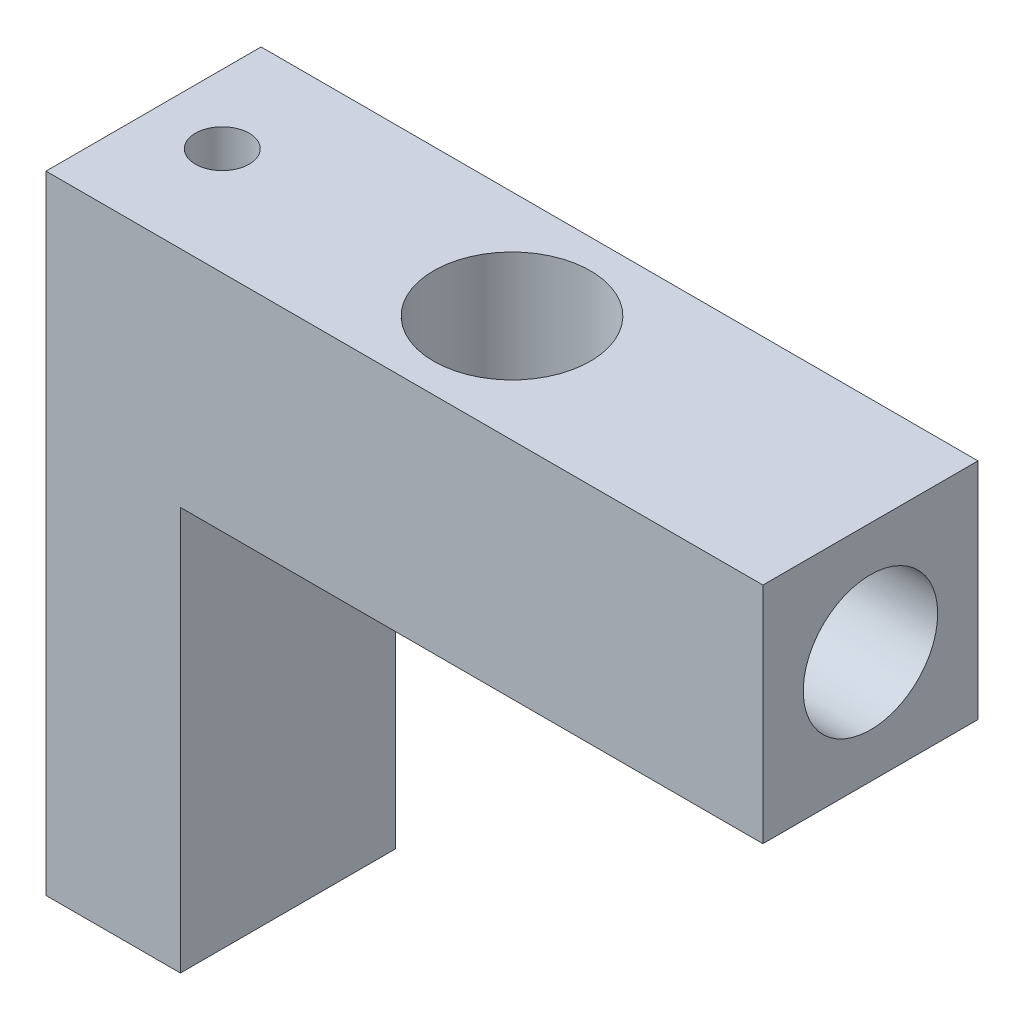
ISO-10303-21;
HEADER;
FILE_DESCRIPTION(('STEP AP214'),'2;1');
FILE_NAME('part.step','',(''),(''),'','','');
FILE_SCHEMA(('AUTOMOTIVE_DESIGN { 1 0 10303 214 1 1 1 1 }'));
ENDSEC;
DATA;
#1=APPLICATION_CONTEXT('core data for automotive mechanical design processes');
#2=APPLICATION_PROTOCOL_DEFINITION('international standard','automotive_design',2000,#1);
#3=PRODUCT_CONTEXT('',#1,'mechanical');
#4=PRODUCT('Part','Part','',(#3));
#5=PRODUCT_RELATED_PRODUCT_CATEGORY('part','',(#4));
#6=PRODUCT_DEFINITION_FORMATION('','',#4);
#7=PRODUCT_DEFINITION_CONTEXT('part definition',#1,'design');
#8=PRODUCT_DEFINITION('design','',#6,#7);
#9=PRODUCT_DEFINITION_SHAPE('','',#8);
#10=(LENGTH_UNIT() NAMED_UNIT(*) SI_UNIT(.MILLI.,.METRE.));
#11=(NAMED_UNIT(*) PLANE_ANGLE_UNIT() SI_UNIT($,.RADIAN.));
#12=(NAMED_UNIT(*) SI_UNIT($,.STERADIAN.) SOLID_ANGLE_UNIT());
#13=UNCERTAINTY_MEASURE_WITH_UNIT(LENGTH_MEASURE(1.E-05),#10,'distance_accuracy_value','');
#14=(GEOMETRIC_REPRESENTATION_CONTEXT(3) GLOBAL_UNCERTAINTY_ASSIGNED_CONTEXT((#13)) GLOBAL_UNIT_ASSIGNED_CONTEXT((#10,
#11,#12)) REPRESENTATION_CONTEXT('',''));
#15=CARTESIAN_POINT('',(0.,0.,0.));
#16=DIRECTION('',(0.,0.,1.));
#17=DIRECTION('',(1.,0.,0.));
#18=AXIS2_PLACEMENT_3D('',#15,#16,#17);
#19=CARTESIAN_POINT('',(0.,0.,0.));
#20=DIRECTION('',(0.,1.,0.));
#21=DIRECTION('',(0.,0.,1.));
#22=AXIS2_PLACEMENT_3D('',#19,#20,#21);
#23=PLANE('',#22);
#24=CARTESIAN_POINT('',(0.,0.,0.));
#25=DIRECTION('',(0.,1.,0.));
#26=DIRECTION('',(0.,0.,1.));
#27=AXIS2_PLACEMENT_3D('',#24,#25,#26);
#28=CIRCLE('',#27,1.75);
#29=CARTESIAN_POINT('',(0.,0.,1.75));
#30=VERTEX_POINT('',#29);
#31=EDGE_CURVE('E160',#30,#30,#28,.T.);
#32=ORIENTED_EDGE('',*,*,#31,.T.);
#33=EDGE_LOOP('',(#32));
#34=FACE_BOUND('',#33,.T.);
#35=DIRECTION('',(0.,0.,1.));
#36=VECTOR('',#35,1.);
#37=CARTESIAN_POINT('',(-5.,0.,2.4));
#38=LINE('',#37,#36);
#39=CARTESIAN_POINT('',(-5.,0.,-2.4));
#40=VERTEX_POINT('',#39);
#41=CARTESIAN_POINT('',(-5.,0.,2.4));
#42=VERTEX_POINT('',#41);
#43=EDGE_CURVE('E61',#40,#42,#38,.T.);
#44=ORIENTED_EDGE('',*,*,#43,.F.);
#45=DIRECTION('',(-1.,0.,0.));
#46=VECTOR('',#45,1.);
#47=CARTESIAN_POINT('',(8.,0.,-2.4));
#48=LINE('',#47,#46);
#49=CARTESIAN_POINT('',(8.,0.,-2.4));
#50=VERTEX_POINT('',#49);
#51=EDGE_CURVE('E175',#50,#40,#48,.T.);
#52=ORIENTED_EDGE('',*,*,#51,.F.);
#53=DIRECTION('',(0.,0.,-1.));
#54=VECTOR('',#53,1.);
#55=CARTESIAN_POINT('',(8.,0.,2.4));
#56=LINE('',#55,#54);
#57=CARTESIAN_POINT('',(8.,0.,2.4));
#58=VERTEX_POINT('',#57);
#59=EDGE_CURVE('E86',#58,#50,#56,.T.);
#60=ORIENTED_EDGE('',*,*,#59,.F.);
#61=DIRECTION('',(1.,0.,0.));
#62=VECTOR('',#61,1.);
#63=CARTESIAN_POINT('',(8.,0.,2.4));
#64=LINE('',#63,#62);
#65=EDGE_CURVE('E169',#42,#58,#64,.T.);
#66=ORIENTED_EDGE('',*,*,#65,.F.);
#67=EDGE_LOOP('',(#44,#52,#60,#66));
#68=FACE_BOUND('',#67,.T.);
#69=ADVANCED_FACE('F39',(#34,#68),#23,.F.);
#70=CARTESIAN_POINT('',(0.,5.,0.));
#71=DIRECTION('',(0.,1.,0.));
#72=DIRECTION('',(0.,0.,1.));
#73=AXIS2_PLACEMENT_3D('',#70,#71,#72);
#74=PLANE('',#73);
#75=CARTESIAN_POINT('',(-6.46588902284861,5.,0.));
#76=DIRECTION('',(0.,-1.,0.));
#77=DIRECTION('',(0.,0.,-1.));
#78=AXIS2_PLACEMENT_3D('',#75,#76,#77);
#79=CIRCLE('',#78,0.6);
#80=CARTESIAN_POINT('',(-6.46588902284861,5.,-0.6));
#81=VERTEX_POINT('',#80);
#82=EDGE_CURVE('E136',#81,#81,#79,.T.);
#83=ORIENTED_EDGE('',*,*,#82,.T.);
#84=EDGE_LOOP('',(#83));
#85=FACE_BOUND('',#84,.T.);
#86=DIRECTION('',(0.,0.,1.));
#87=VECTOR('',#86,1.);
#88=CARTESIAN_POINT('',(-8.,5.,2.4));
#89=LINE('',#88,#87);
#90=CARTESIAN_POINT('',(-8.,5.,-2.4));
#91=VERTEX_POINT('',#90);
#92=CARTESIAN_POINT('',(-8.,5.,2.4));
#93=VERTEX_POINT('',#92);
#94=EDGE_CURVE('E114',#91,#93,#89,.T.);
#95=ORIENTED_EDGE('',*,*,#94,.T.);
#96=DIRECTION('',(1.,0.,0.));
#97=VECTOR('',#96,1.);
#98=CARTESIAN_POINT('',(8.,5.,2.4));
#99=LINE('',#98,#97);
#100=CARTESIAN_POINT('',(8.,5.,2.4));
#101=VERTEX_POINT('',#100);
#102=EDGE_CURVE('E93',#93,#101,#99,.T.);
#103=ORIENTED_EDGE('',*,*,#102,.T.);
#104=DIRECTION('',(0.,0.,-1.));
#105=VECTOR('',#104,1.);
#106=CARTESIAN_POINT('',(8.,5.,2.4));
#107=LINE('',#106,#105);
#108=CARTESIAN_POINT('',(8.,5.,-2.4));
#109=VERTEX_POINT('',#108);
#110=EDGE_CURVE('E178',#101,#109,#107,.T.);
#111=ORIENTED_EDGE('',*,*,#110,.T.);
#112=DIRECTION('',(-1.,0.,0.));
#113=VECTOR('',#112,1.);
#114=CARTESIAN_POINT('',(8.,5.,-2.4));
#115=LINE('',#114,#113);
#116=EDGE_CURVE('E70',#109,#91,#115,.T.);
#117=ORIENTED_EDGE('',*,*,#116,.T.);
#118=EDGE_LOOP('',(#95,#103,#111,#117));
#119=FACE_BOUND('',#118,.T.);
#120=CARTESIAN_POINT('',(0.,5.,0.));
#121=DIRECTION('',(0.,1.,0.));
#122=DIRECTION('',(0.,0.,1.));
#123=AXIS2_PLACEMENT_3D('',#120,#121,#122);
#124=CIRCLE('',#123,1.75);
#125=CARTESIAN_POINT('',(0.,5.,1.75));
#126=VERTEX_POINT('',#125);
#127=EDGE_CURVE('E165',#126,#126,#124,.T.);
#128=ORIENTED_EDGE('',*,*,#127,.F.);
#129=EDGE_LOOP('',(#128));
#130=FACE_BOUND('',#129,.T.);
#131=ADVANCED_FACE('F205',(#85,#119,#130),#74,.T.);
#132=CARTESIAN_POINT('',(-8.,5.,2.4));
#133=DIRECTION('',(1.,0.,0.));
#134=DIRECTION('',(0.,0.,-1.));
#135=AXIS2_PLACEMENT_3D('',#132,#133,#134);
#136=PLANE('',#135);
#137=DIRECTION('',(0.,-1.,0.));
#138=VECTOR('',#137,1.);
#139=CARTESIAN_POINT('',(-8.,5.,-2.4));
#140=LINE('',#139,#138);
#141=CARTESIAN_POINT('',(-8.,-9.,-2.4));
#142=VERTEX_POINT('',#141);
#143=EDGE_CURVE('E109',#91,#142,#140,.T.);
#144=ORIENTED_EDGE('',*,*,#143,.T.);
#145=DIRECTION('',(0.,0.,-1.));
#146=VECTOR('',#145,1.);
#147=CARTESIAN_POINT('',(-8.,-9.,2.4));
#148=LINE('',#147,#146);
#149=CARTESIAN_POINT('',(-8.,-9.,2.4));
#150=VERTEX_POINT('',#149);
#151=EDGE_CURVE('E113',#150,#142,#148,.T.);
#152=ORIENTED_EDGE('',*,*,#151,.F.);
#153=DIRECTION('',(0.,-1.,0.));
#154=VECTOR('',#153,1.);
#155=CARTESIAN_POINT('',(-8.,5.,2.4));
#156=LINE('',#155,#154);
#157=EDGE_CURVE('E11',#93,#150,#156,.T.);
#158=ORIENTED_EDGE('',*,*,#157,.F.);
#159=ORIENTED_EDGE('',*,*,#94,.F.);
#160=EDGE_LOOP('',(#144,#152,#158,#159));
#161=FACE_BOUND('',#160,.T.);
#162=ADVANCED_FACE('F41',(#161),#136,.F.);
#163=CARTESIAN_POINT('',(8.,5.,2.4));
#164=DIRECTION('',(0.,0.,-1.));
#165=DIRECTION('',(-1.,0.,0.));
#166=AXIS2_PLACEMENT_3D('',#163,#164,#165);
#167=PLANE('',#166);
#168=ORIENTED_EDGE('',*,*,#157,.T.);
#169=DIRECTION('',(-1.,0.,0.));
#170=VECTOR('',#169,1.);
#171=CARTESIAN_POINT('',(-8.,-9.,2.4));
#172=LINE('',#171,#170);
#173=CARTESIAN_POINT('',(-5.,-9.,2.4));
#174=VERTEX_POINT('',#173);
#175=EDGE_CURVE('E132',#174,#150,#172,.T.);
#176=ORIENTED_EDGE('',*,*,#175,.F.);
#177=DIRECTION('',(0.,1.,0.));
#178=VECTOR('',#177,1.);
#179=CARTESIAN_POINT('',(-5.,-9.,2.4));
#180=LINE('',#179,#178);
#181=EDGE_CURVE('E145',#174,#42,#180,.T.);
#182=ORIENTED_EDGE('',*,*,#181,.T.);
#183=ORIENTED_EDGE('',*,*,#65,.T.);
#184=DIRECTION('',(0.,-1.,0.));
#185=VECTOR('',#184,1.);
#186=CARTESIAN_POINT('',(8.,5.,2.4));
#187=LINE('',#186,#185);
#188=EDGE_CURVE('E54',#101,#58,#187,.T.);
#189=ORIENTED_EDGE('',*,*,#188,.F.);
#190=ORIENTED_EDGE('',*,*,#102,.F.);
#191=EDGE_LOOP('',(#168,#176,#182,#183,#189,#190));
#192=FACE_BOUND('',#191,.T.);
#193=ADVANCED_FACE('F197',(#192),#167,.F.);
#194=CARTESIAN_POINT('',(8.,5.,2.4));
#195=DIRECTION('',(-1.,0.,0.));
#196=DIRECTION('',(0.,0.,1.));
#197=AXIS2_PLACEMENT_3D('',#194,#195,#196);
#198=PLANE('',#197);
#199=CARTESIAN_POINT('',(8.,2.5,0.));
#200=DIRECTION('',(1.,0.,0.));
#201=DIRECTION('',(0.,0.,-1.));
#202=AXIS2_PLACEMENT_3D('',#199,#200,#201);
#203=CIRCLE('',#202,1.5);
#204=CARTESIAN_POINT('',(8.,2.5,-1.5));
#205=VERTEX_POINT('',#204);
#206=EDGE_CURVE('E161',#205,#205,#203,.T.);
#207=ORIENTED_EDGE('',*,*,#206,.F.);
#208=EDGE_LOOP('',(#207));
#209=FACE_BOUND('',#208,.T.);
#210=ORIENTED_EDGE('',*,*,#59,.T.);
#211=DIRECTION('',(0.,-1.,0.));
#212=VECTOR('',#211,1.);
#213=CARTESIAN_POINT('',(8.,5.,-2.4));
#214=LINE('',#213,#212);
#215=EDGE_CURVE('E117',#109,#50,#214,.T.);
#216=ORIENTED_EDGE('',*,*,#215,.F.);
#217=ORIENTED_EDGE('',*,*,#110,.F.);
#218=ORIENTED_EDGE('',*,*,#188,.T.);
#219=EDGE_LOOP('',(#210,#216,#217,#218));
#220=FACE_BOUND('',#219,.T.);
#221=ADVANCED_FACE('F193',(#209,#220),#198,.F.);
#222=CARTESIAN_POINT('',(8.,5.,-2.4));
#223=DIRECTION('',(0.,0.,1.));
#224=DIRECTION('',(1.,0.,0.));
#225=AXIS2_PLACEMENT_3D('',#222,#223,#224);
#226=PLANE('',#225);
#227=ORIENTED_EDGE('',*,*,#51,.T.);
#228=DIRECTION('',(0.,1.,0.));
#229=VECTOR('',#228,1.);
#230=CARTESIAN_POINT('',(-5.,-9.,-2.4));
#231=LINE('',#230,#229);
#232=CARTESIAN_POINT('',(-5.,-9.,-2.4));
#233=VERTEX_POINT('',#232);
#234=EDGE_CURVE('E123',#233,#40,#231,.T.);
#235=ORIENTED_EDGE('',*,*,#234,.F.);
#236=DIRECTION('',(1.,0.,0.));
#237=VECTOR('',#236,1.);
#238=CARTESIAN_POINT('',(-8.,-9.,-2.4));
#239=LINE('',#238,#237);
#240=EDGE_CURVE('E120',#142,#233,#239,.T.);
#241=ORIENTED_EDGE('',*,*,#240,.F.);
#242=ORIENTED_EDGE('',*,*,#143,.F.);
#243=ORIENTED_EDGE('',*,*,#116,.F.);
#244=ORIENTED_EDGE('',*,*,#215,.T.);
#245=EDGE_LOOP('',(#227,#235,#241,#242,#243,#244));
#246=FACE_BOUND('',#245,.T.);
#247=ADVANCED_FACE('F121',(#246),#226,.F.);
#248=CARTESIAN_POINT('',(0.,5.,0.));
#249=DIRECTION('',(0.,-1.,0.));
#250=DIRECTION('',(0.,0.,-1.));
#251=AXIS2_PLACEMENT_3D('',#248,#249,#250);
#252=CYLINDRICAL_SURFACE('',#251,1.75);
#253=CARTESIAN_POINT('',(1.66132477258362,2.5,-0.55));
#254=CARTESIAN_POINT('',(1.66132493750972,2.46993686582327,-0.54999982321884));
#255=CARTESIAN_POINT('',(1.66214972896379,2.43987190685431,-0.547526746616077));
#256=CARTESIAN_POINT('',(1.66534498206602,2.38062587690329,-0.537728501989825));
#257=CARTESIAN_POINT('',(1.6677158473173,2.35144503880341,-0.530402066987436));
#258=CARTESIAN_POINT('',(1.6737087700032,2.29483406633599,-0.511174397005002));
#259=CARTESIAN_POINT('',(1.67732859266841,2.26740090799528,-0.499281328876751));
#260=CARTESIAN_POINT('',(1.68540845010023,2.21491152300886,-0.471285299993899));
#261=CARTESIAN_POINT('',(1.68986863647378,2.18985572648259,-0.455181579407266));
#262=CARTESIAN_POINT('',(1.6993004987853,2.14196165795903,-0.418622094988196));
#263=CARTESIAN_POINT('',(1.7042838636915,2.11921814353238,-0.398045182088362));
#264=CARTESIAN_POINT('',(1.71410117830469,2.07744114695325,-0.353382595201496));
#265=CARTESIAN_POINT('',(1.71893510681755,2.05840818904517,-0.329296426249482));
#266=CARTESIAN_POINT('',(1.72804273835545,2.0241734564028,-0.277617107045007));
#267=CARTESIAN_POINT('',(1.73230107521367,2.00906940912716,-0.249956271666683));
#268=CARTESIAN_POINT('',(1.73964112323645,1.98376494970475,-0.19233025486475));
#269=CARTESIAN_POINT('',(1.74272311427468,1.97356337102332,-0.162365623596166));
#270=CARTESIAN_POINT('',(1.74728047242685,1.95867023429237,-0.101974873867498));
#271=CARTESIAN_POINT('',(1.74880296770252,1.95381668861185,-0.0715923252630936));
#272=CARTESIAN_POINT('',(1.75023630918134,1.94924399629186,-0.0104085235998297));
#273=CARTESIAN_POINT('',(1.75014752581693,1.94952366952721,0.0203926315944382));
#274=CARTESIAN_POINT('',(1.74840105558102,1.9551032323404,0.0803986868552374));
#275=CARTESIAN_POINT('',(1.74679825777856,1.96022749190045,0.109621770893423));
#276=CARTESIAN_POINT('',(1.74227147615191,1.97506240290688,0.166769965471235));
#277=CARTESIAN_POINT('',(1.73934740583623,1.9847733546035,0.194694990906955));
#278=CARTESIAN_POINT('',(1.73243326495131,2.00861796605645,0.24885782826664));
#279=CARTESIAN_POINT('',(1.7284305040595,2.02280464392539,0.275070612750757));
#280=CARTESIAN_POINT('',(1.71978029690319,2.05515537453754,0.324797933430703));
#281=CARTESIAN_POINT('',(1.71513268630115,2.0733204418432,0.348311779011997));
#282=CARTESIAN_POINT('',(1.70545599317789,2.11401264026693,0.393020819989259));
#283=CARTESIAN_POINT('',(1.70041908844632,2.13669129938688,0.41407660098063));
#284=CARTESIAN_POINT('',(1.69070014648252,2.18530452271734,0.452127956140296));
#285=CARTESIAN_POINT('',(1.68601815209932,2.21123947906626,0.469123040583905));
#286=CARTESIAN_POINT('',(1.67749939777943,2.26602696573684,0.498735288931937));
#287=CARTESIAN_POINT('',(1.67367290414621,2.2949094400216,0.511300224942783));
#288=CARTESIAN_POINT('',(1.66741867882843,2.35452963265562,0.531344027349455));
#289=CARTESIAN_POINT('',(1.66499043778638,2.38526667090804,0.538824746010644));
#290=CARTESIAN_POINT('',(1.66192089910417,2.44638652924762,0.548217564420321));
#291=CARTESIAN_POINT('',(1.66121106783229,2.47673308328049,0.550343376566184));
#292=CARTESIAN_POINT('',(1.66146833067353,2.53735158513708,0.549566448015891));
#293=CARTESIAN_POINT('',(1.66243516202284,2.56762354390671,0.54666449526284));
#294=CARTESIAN_POINT('',(1.66586909555842,2.62630918343245,0.536105496273811));
#295=CARTESIAN_POINT('',(1.66829132383563,2.65475132812454,0.528590537492945));
#296=CARTESIAN_POINT('',(1.67431542979503,2.70996761665544,0.50918597575023));
#297=CARTESIAN_POINT('',(1.67791750131633,2.73674148554855,0.497295653910404));
#298=CARTESIAN_POINT('',(1.68602481992422,2.78871881780402,0.469085320193651));
#299=CARTESIAN_POINT('',(1.69055318847098,2.81385440818007,0.452647069469823));
#300=CARTESIAN_POINT('',(1.6999552513153,2.86108816772894,0.415945193594723));
#301=CARTESIAN_POINT('',(1.70482903613026,2.88318553623292,0.395680563396317));
#302=CARTESIAN_POINT('',(1.71462041535391,2.92467292644771,0.350889093909756));
#303=CARTESIAN_POINT('',(1.71953125571284,2.94391030107764,0.326219011785775));
#304=CARTESIAN_POINT('',(1.72863911988479,2.97797848775901,0.27388186393735));
#305=CARTESIAN_POINT('',(1.73283617590213,2.99280949863811,0.246214933516121));
#306=CARTESIAN_POINT('',(1.74001990641037,3.01750202146644,0.188837580641653));
#307=CARTESIAN_POINT('',(1.7430152570996,3.02739928544751,0.15914368663398));
#308=CARTESIAN_POINT('',(1.74749620366367,3.04202591394991,0.098401927472108));
#309=CARTESIAN_POINT('',(1.74898227794364,3.04675691609054,0.0673544946143246));
#310=CARTESIAN_POINT('',(1.75024516297117,3.05078247532423,0.00619134984853068));
#311=CARTESIAN_POINT('',(1.75009126306077,3.0502974046969,-0.0239085977126394));
#312=CARTESIAN_POINT('',(1.74825784491332,3.04443839961653,-0.0835786981473618));
#313=CARTESIAN_POINT('',(1.74657842809307,3.03906479015494,-0.113148886106231));
#314=CARTESIAN_POINT('',(1.74190490145202,3.02372209524057,-0.170548438721182));
#315=CARTESIAN_POINT('',(1.73892786037387,3.01381259207947,-0.19839521612821));
#316=CARTESIAN_POINT('',(1.73196603085874,2.98973332312355,-0.252044120764177));
#317=CARTESIAN_POINT('',(1.72798106865151,2.97556282263348,-0.277845894416586));
#318=CARTESIAN_POINT('',(1.71924924924425,2.94280372281994,-0.327632340752122));
#319=CARTESIAN_POINT('',(1.71448100237665,2.92408064238532,-0.351524734952143));
#320=CARTESIAN_POINT('',(1.70478118030165,2.88298433239211,-0.395901600363276));
#321=CARTESIAN_POINT('',(1.69984955631279,2.86061000466386,-0.416385042523484));
#322=CARTESIAN_POINT('',(1.69018427609254,2.81194478129564,-0.454057993491287));
#323=CARTESIAN_POINT('',(1.68546285173412,2.78554749151355,-0.471113590440285));
#324=CARTESIAN_POINT('',(1.67696362359322,2.73011887538269,-0.500528421153911));
#325=CARTESIAN_POINT('',(1.67318544915138,2.70108858982866,-0.512889500673901));
#326=CARTESIAN_POINT('',(1.66730062080908,2.64366226891098,-0.53169341595426));
#327=CARTESIAN_POINT('',(1.66508241470142,2.61540900131185,-0.538538032204943));
#328=CARTESIAN_POINT('',(1.66209459462863,2.55810425429559,-0.547690834267084));
#329=CARTESIAN_POINT('',(1.66132461319922,2.52905297925898,-0.550000170841115));
#330=CARTESIAN_POINT('',(1.66132477258362,2.5,-0.55));
#331=B_SPLINE_CURVE_WITH_KNOTS('',3,(#253,#254,#255,#256,#257,#258,#259,#260,#261,#262,#263,
#264,#265,#266,#267,#268,#269,#270,#271,#272,#273,#274,#275,#276,#277,#278,#279,#280,#281,#282,
#283,#284,#285,#286,#287,#288,#289,#290,#291,#292,#293,#294,#295,#296,#297,#298,#299,#300,#301,
#302,#303,#304,#305,#306,#307,#308,#309,#310,#311,#312,#313,#314,#315,#316,#317,#318,#319,#320,
#321,#322,#323,#324,#325,#326,#327,#328,#329,#330),.UNSPECIFIED.,.T.,.F.,(4,2,2,2,2,2,2,2,2,2,2,
2,2,2,2,2,2,2,2,2,2,2,2,2,2,2,2,2,2,2,2,2,2,2,2,2,2,2,4),(0.,0.090082060214538,0.1801876458027,
0.270132833758986,0.360094263962624,0.452890520316302,0.545699877863358,0.64063481224337,
0.735547145806874,0.827498105266196,0.919427925497903,1.00814786599687,1.09687361501231,
1.18669255647235,1.27653443014068,1.37016121825657,1.46379929217813,1.55850701945394,
1.6531802245997,1.7440105107819,1.83482656347751,1.92297669201534,2.0111413102081,
2.10185746057829,2.1925974719266,2.28714774366046,2.38169374836901,2.47554429426474,
2.56936508245127,2.65923819014322,2.749105323482,2.83782444009039,2.92655886272262,
3.01832688385641,3.11012255669837,3.20500473991376,3.29984957934393,3.38692687910675,
3.47398208138984),.UNSPECIFIED.);
#332=CARTESIAN_POINT('',(1.66132477258362,2.5,-0.55));
#333=VERTEX_POINT('',#332);
#334=EDGE_CURVE('E43',#333,#333,#331,.T.);
#335=ORIENTED_EDGE('',*,*,#334,.F.);
#336=EDGE_LOOP('',(#335));
#337=FACE_BOUND('',#336,.T.);
#338=ORIENTED_EDGE('',*,*,#127,.T.);
#339=EDGE_LOOP('',(#338));
#340=FACE_BOUND('',#339,.T.);
#341=ORIENTED_EDGE('',*,*,#31,.F.);
#342=EDGE_LOOP('',(#341));
#343=FACE_BOUND('',#342,.T.);
#344=ADVANCED_FACE('F216',(#337,#340,#343),#252,.F.);
#345=CARTESIAN_POINT('',(5.,2.5,0.));
#346=DIRECTION('',(1.,0.,0.));
#347=DIRECTION('',(0.,0.,-1.));
#348=AXIS2_PLACEMENT_3D('',#345,#346,#347);
#349=CYLINDRICAL_SURFACE('',#348,1.5);
#350=CARTESIAN_POINT('',(5.,2.5,0.));
#351=DIRECTION('',(1.,0.,0.));
#352=DIRECTION('',(0.,0.,-1.));
#353=AXIS2_PLACEMENT_3D('',#350,#351,#352);
#354=CIRCLE('',#353,1.5);
#355=CARTESIAN_POINT('',(5.,2.5,-1.5));
#356=VERTEX_POINT('',#355);
#357=EDGE_CURVE('E156',#356,#356,#354,.T.);
#358=ORIENTED_EDGE('',*,*,#357,.F.);
#359=EDGE_LOOP('',(#358));
#360=FACE_BOUND('',#359,.T.);
#361=ORIENTED_EDGE('',*,*,#206,.T.);
#362=EDGE_LOOP('',(#361));
#363=FACE_BOUND('',#362,.T.);
#364=ADVANCED_FACE('F220',(#360,#363),#349,.F.);
#365=CARTESIAN_POINT('',(5.,2.5,0.));
#366=DIRECTION('',(1.,0.,0.));
#367=DIRECTION('',(0.,0.,-1.));
#368=AXIS2_PLACEMENT_3D('',#365,#366,#367);
#369=PLANE('',#368);
#370=CARTESIAN_POINT('',(5.,2.5,0.));
#371=DIRECTION('',(1.,0.,0.));
#372=DIRECTION('',(0.,0.,-1.));
#373=AXIS2_PLACEMENT_3D('',#370,#371,#372);
#374=CIRCLE('',#373,0.55);
#375=CARTESIAN_POINT('',(5.,2.5,-0.55));
#376=VERTEX_POINT('',#375);
#377=EDGE_CURVE('E152',#376,#376,#374,.T.);
#378=ORIENTED_EDGE('',*,*,#377,.F.);
#379=EDGE_LOOP('',(#378));
#380=FACE_BOUND('',#379,.T.);
#381=ORIENTED_EDGE('',*,*,#357,.T.);
#382=EDGE_LOOP('',(#381));
#383=FACE_BOUND('',#382,.T.);
#384=ADVANCED_FACE('F225',(#380,#383),#369,.T.);
#385=CARTESIAN_POINT('',(0.999999999999998,2.5,0.));
#386=DIRECTION('',(1.,0.,0.));
#387=DIRECTION('',(0.,0.,-1.));
#388=AXIS2_PLACEMENT_3D('',#385,#386,#387);
#389=CYLINDRICAL_SURFACE('',#388,0.55);
#390=ORIENTED_EDGE('',*,*,#334,.T.);
#391=EDGE_LOOP('',(#390));
#392=FACE_BOUND('',#391,.T.);
#393=ORIENTED_EDGE('',*,*,#377,.T.);
#394=EDGE_LOOP('',(#393));
#395=FACE_BOUND('',#394,.T.);
#396=ADVANCED_FACE('F233',(#392,#395),#389,.F.);
#397=CARTESIAN_POINT('',(-5.,-9.,2.4));
#398=DIRECTION('',(-1.,0.,0.));
#399=DIRECTION('',(0.,0.,1.));
#400=AXIS2_PLACEMENT_3D('',#397,#398,#399);
#401=PLANE('',#400);
#402=ORIENTED_EDGE('',*,*,#43,.T.);
#403=ORIENTED_EDGE('',*,*,#181,.F.);
#404=DIRECTION('',(0.,0.,1.));
#405=VECTOR('',#404,1.);
#406=CARTESIAN_POINT('',(-5.,-9.,2.4));
#407=LINE('',#406,#405);
#408=EDGE_CURVE('E127',#233,#174,#407,.T.);
#409=ORIENTED_EDGE('',*,*,#408,.F.);
#410=ORIENTED_EDGE('',*,*,#234,.T.);
#411=EDGE_LOOP('',(#402,#403,#409,#410));
#412=FACE_BOUND('',#411,.T.);
#413=ADVANCED_FACE('F195',(#412),#401,.F.);
#414=CARTESIAN_POINT('',(0.,-9.,0.));
#415=DIRECTION('',(0.,-1.,0.));
#416=DIRECTION('',(0.,0.,-1.));
#417=AXIS2_PLACEMENT_3D('',#414,#415,#416);
#418=PLANE('',#417);
#419=CARTESIAN_POINT('',(-6.46588902284861,-9.,0.));
#420=DIRECTION('',(0.,-1.,0.));
#421=DIRECTION('',(0.,0.,-1.));
#422=AXIS2_PLACEMENT_3D('',#419,#420,#421);
#423=CIRCLE('',#422,0.6);
#424=CARTESIAN_POINT('',(-6.46588902284861,-9.,-0.6));
#425=VERTEX_POINT('',#424);
#426=EDGE_CURVE('E139',#425,#425,#423,.T.);
#427=ORIENTED_EDGE('',*,*,#426,.F.);
#428=EDGE_LOOP('',(#427));
#429=FACE_BOUND('',#428,.T.);
#430=ORIENTED_EDGE('',*,*,#151,.T.);
#431=ORIENTED_EDGE('',*,*,#240,.T.);
#432=ORIENTED_EDGE('',*,*,#408,.T.);
#433=ORIENTED_EDGE('',*,*,#175,.T.);
#434=EDGE_LOOP('',(#430,#431,#432,#433));
#435=FACE_BOUND('',#434,.T.);
#436=ADVANCED_FACE('F130',(#429,#435),#418,.T.);
#437=CARTESIAN_POINT('',(-6.46588902284861,5.,0.));
#438=DIRECTION('',(0.,-1.,0.));
#439=DIRECTION('',(0.,0.,-1.));
#440=AXIS2_PLACEMENT_3D('',#437,#438,#439);
#441=CYLINDRICAL_SURFACE('',#440,0.6);
#442=ORIENTED_EDGE('',*,*,#82,.F.);
#443=EDGE_LOOP('',(#442));
#444=FACE_BOUND('',#443,.T.);
#445=ORIENTED_EDGE('',*,*,#426,.T.);
#446=EDGE_LOOP('',(#445));
#447=FACE_BOUND('',#446,.T.);
#448=ADVANCED_FACE('F243',(#444,#447),#441,.F.);
#449=CLOSED_SHELL('',(#69,#131,#162,#193,#221,#247,#344,#364,#384,#396,#413,#436,#448));
#450=MANIFOLD_SOLID_BREP('B2',#449);
#451=ADVANCED_BREP_SHAPE_REPRESENTATION('',(#18,#450),#14);
#452=SHAPE_DEFINITION_REPRESENTATION(#9,#451);
ENDSEC;
END-ISO-10303-21;
